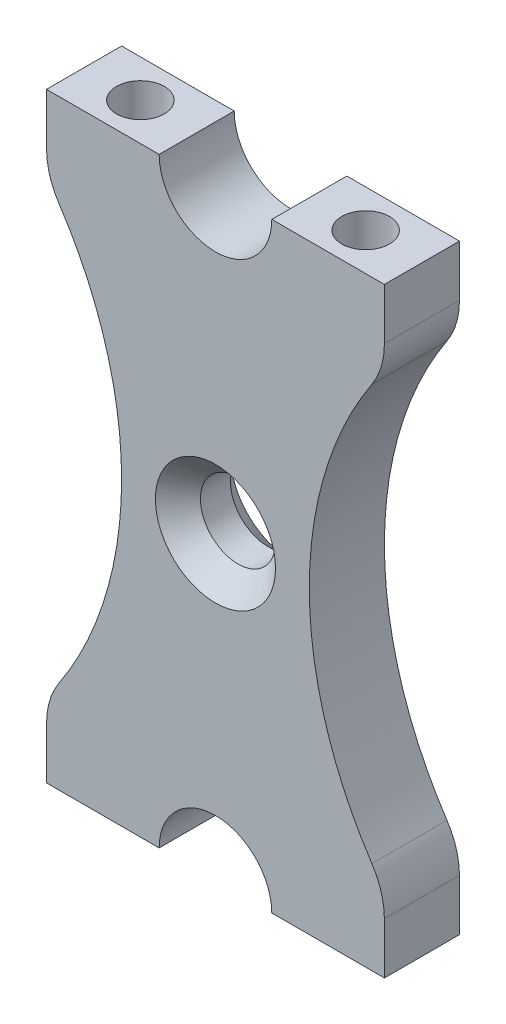
ISO-10303-21;
HEADER;
FILE_DESCRIPTION(('STEP AP214'),'2;1');
FILE_NAME('part.step','',(''),(''),'','','');
FILE_SCHEMA(('AUTOMOTIVE_DESIGN { 1 0 10303 214 1 1 1 1 }'));
ENDSEC;
DATA;
#1=APPLICATION_CONTEXT('core data for automotive mechanical design processes');
#2=APPLICATION_PROTOCOL_DEFINITION('international standard','automotive_design',2000,#1);
#3=PRODUCT_CONTEXT('',#1,'mechanical');
#4=PRODUCT('Part','Part','',(#3));
#5=PRODUCT_RELATED_PRODUCT_CATEGORY('part','',(#4));
#6=PRODUCT_DEFINITION_FORMATION('','',#4);
#7=PRODUCT_DEFINITION_CONTEXT('part definition',#1,'design');
#8=PRODUCT_DEFINITION('design','',#6,#7);
#9=PRODUCT_DEFINITION_SHAPE('','',#8);
#10=(LENGTH_UNIT() NAMED_UNIT(*) SI_UNIT(.MILLI.,.METRE.));
#11=(NAMED_UNIT(*) PLANE_ANGLE_UNIT() SI_UNIT($,.RADIAN.));
#12=(NAMED_UNIT(*) SI_UNIT($,.STERADIAN.) SOLID_ANGLE_UNIT());
#13=UNCERTAINTY_MEASURE_WITH_UNIT(LENGTH_MEASURE(1.E-05),#10,'distance_accuracy_value','');
#14=(GEOMETRIC_REPRESENTATION_CONTEXT(3) GLOBAL_UNCERTAINTY_ASSIGNED_CONTEXT((#13)) GLOBAL_UNIT_ASSIGNED_CONTEXT((#10,
#11,#12)) REPRESENTATION_CONTEXT('',''));
#15=CARTESIAN_POINT('',(0.,0.,0.));
#16=DIRECTION('',(0.,0.,1.));
#17=DIRECTION('',(1.,0.,0.));
#18=AXIS2_PLACEMENT_3D('',#15,#16,#17);
#19=CARTESIAN_POINT('',(14.2875,25.4,6.35));
#20=DIRECTION('',(-1.,0.,0.));
#21=DIRECTION('',(0.,-1.,0.));
#22=AXIS2_PLACEMENT_3D('',#19,#20,#21);
#23=PLANE('',#22);
#24=DIRECTION('',(0.,1.,0.));
#25=VECTOR('',#24,1.);
#26=CARTESIAN_POINT('',(14.2875,25.4,0.));
#27=LINE('',#26,#25);
#28=CARTESIAN_POINT('',(14.2875,-25.4,0.));
#29=VERTEX_POINT('',#28);
#30=CARTESIAN_POINT('',(14.2875,-21.0605674187568,0.));
#31=VERTEX_POINT('',#30);
#32=EDGE_CURVE('E189',#29,#31,#27,.T.);
#33=ORIENTED_EDGE('',*,*,#32,.T.);
#34=DIRECTION('',(0.,0.,1.));
#35=VECTOR('',#34,1.);
#36=CARTESIAN_POINT('',(14.2875,-21.0605674187568,6.35));
#37=LINE('',#36,#35);
#38=CARTESIAN_POINT('',(14.2875,-21.0605674187568,6.35));
#39=VERTEX_POINT('',#38);
#40=EDGE_CURVE('E247',#31,#39,#37,.T.);
#41=ORIENTED_EDGE('',*,*,#40,.T.);
#42=DIRECTION('',(0.,1.,0.));
#43=VECTOR('',#42,1.);
#44=CARTESIAN_POINT('',(14.2875,25.4,6.35));
#45=LINE('',#44,#43);
#46=CARTESIAN_POINT('',(14.2875,-25.4,6.35));
#47=VERTEX_POINT('',#46);
#48=EDGE_CURVE('E322',#47,#39,#45,.T.);
#49=ORIENTED_EDGE('',*,*,#48,.F.);
#50=DIRECTION('',(0.,0.,-1.));
#51=VECTOR('',#50,1.);
#52=CARTESIAN_POINT('',(14.2875,-25.4,6.35));
#53=LINE('',#52,#51);
#54=EDGE_CURVE('E202',#47,#29,#53,.T.);
#55=ORIENTED_EDGE('',*,*,#54,.T.);
#56=EDGE_LOOP('',(#33,#41,#49,#55));
#57=FACE_BOUND('',#56,.T.);
#58=ADVANCED_FACE('F37',(#57),#23,.F.);
#59=CARTESIAN_POINT('',(-14.2875,25.4,6.35));
#60=DIRECTION('',(0.,-1.,0.));
#61=DIRECTION('',(0.,0.,-1.));
#62=AXIS2_PLACEMENT_3D('',#59,#60,#61);
#63=PLANE('',#62);
#64=CARTESIAN_POINT('',(9.525,25.4,3.175));
#65=DIRECTION('',(0.,1.,0.));
#66=DIRECTION('',(0.,0.,1.));
#67=AXIS2_PLACEMENT_3D('',#64,#65,#66);
#68=CIRCLE('',#67,2.0193);
#69=CARTESIAN_POINT('',(9.525,25.4,5.1943));
#70=VERTEX_POINT('',#69);
#71=EDGE_CURVE('E316',#70,#70,#68,.T.);
#72=ORIENTED_EDGE('',*,*,#71,.F.);
#73=EDGE_LOOP('',(#72));
#74=FACE_BOUND('',#73,.T.);
#75=DIRECTION('',(-1.,0.,0.));
#76=VECTOR('',#75,1.);
#77=CARTESIAN_POINT('',(-14.2875,25.4,0.));
#78=LINE('',#77,#76);
#79=CARTESIAN_POINT('',(14.2875,25.4,0.));
#80=VERTEX_POINT('',#79);
#81=CARTESIAN_POINT('',(4.7625,25.4,0.));
#82=VERTEX_POINT('',#81);
#83=EDGE_CURVE('E188',#80,#82,#78,.T.);
#84=ORIENTED_EDGE('',*,*,#83,.T.);
#85=DIRECTION('',(0.,0.,1.));
#86=VECTOR('',#85,1.);
#87=CARTESIAN_POINT('',(4.7625,25.4,0.));
#88=LINE('',#87,#86);
#89=CARTESIAN_POINT('',(4.7625,25.4,6.35));
#90=VERTEX_POINT('',#89);
#91=EDGE_CURVE('E170',#82,#90,#88,.T.);
#92=ORIENTED_EDGE('',*,*,#91,.T.);
#93=DIRECTION('',(-1.,0.,0.));
#94=VECTOR('',#93,1.);
#95=CARTESIAN_POINT('',(-14.2875,25.4,6.35));
#96=LINE('',#95,#94);
#97=CARTESIAN_POINT('',(14.2875,25.4,6.35));
#98=VERTEX_POINT('',#97);
#99=EDGE_CURVE('E325',#98,#90,#96,.T.);
#100=ORIENTED_EDGE('',*,*,#99,.F.);
#101=DIRECTION('',(0.,0.,-1.));
#102=VECTOR('',#101,1.);
#103=CARTESIAN_POINT('',(14.2875,25.4,6.35));
#104=LINE('',#103,#102);
#105=EDGE_CURVE('E211',#98,#80,#104,.T.);
#106=ORIENTED_EDGE('',*,*,#105,.T.);
#107=EDGE_LOOP('',(#84,#92,#100,#106));
#108=FACE_BOUND('',#107,.T.);
#109=ADVANCED_FACE('F359',(#74,#108),#63,.F.);
#110=CARTESIAN_POINT('',(-14.2875,25.4,6.35));
#111=DIRECTION('',(1.,0.,0.));
#112=DIRECTION('',(0.,1.,0.));
#113=AXIS2_PLACEMENT_3D('',#110,#111,#112);
#114=PLANE('',#113);
#115=DIRECTION('',(0.,-1.,0.));
#116=VECTOR('',#115,1.);
#117=CARTESIAN_POINT('',(-14.2875,25.4,0.));
#118=LINE('',#117,#116);
#119=CARTESIAN_POINT('',(-14.2875,25.4,0.));
#120=VERTEX_POINT('',#119);
#121=CARTESIAN_POINT('',(-14.2875,21.0605674187568,0.));
#122=VERTEX_POINT('',#121);
#123=EDGE_CURVE('E187',#120,#122,#118,.T.);
#124=ORIENTED_EDGE('',*,*,#123,.T.);
#125=DIRECTION('',(0.,0.,1.));
#126=VECTOR('',#125,1.);
#127=CARTESIAN_POINT('',(-14.2875,21.0605674187568,6.35));
#128=LINE('',#127,#126);
#129=CARTESIAN_POINT('',(-14.2875,21.0605674187568,6.35));
#130=VERTEX_POINT('',#129);
#131=EDGE_CURVE('E11',#122,#130,#128,.T.);
#132=ORIENTED_EDGE('',*,*,#131,.T.);
#133=DIRECTION('',(0.,-1.,0.));
#134=VECTOR('',#133,1.);
#135=CARTESIAN_POINT('',(-14.2875,25.4,6.35));
#136=LINE('',#135,#134);
#137=CARTESIAN_POINT('',(-14.2875,25.4,6.35));
#138=VERTEX_POINT('',#137);
#139=EDGE_CURVE('E328',#138,#130,#136,.T.);
#140=ORIENTED_EDGE('',*,*,#139,.F.);
#141=DIRECTION('',(0.,0.,-1.));
#142=VECTOR('',#141,1.);
#143=CARTESIAN_POINT('',(-14.2875,25.4,6.35));
#144=LINE('',#143,#142);
#145=EDGE_CURVE('E209',#138,#120,#144,.T.);
#146=ORIENTED_EDGE('',*,*,#145,.T.);
#147=EDGE_LOOP('',(#124,#132,#140,#146));
#148=FACE_BOUND('',#147,.T.);
#149=ADVANCED_FACE('F362',(#148),#114,.F.);
#150=CARTESIAN_POINT('',(-14.2875,-25.4,6.35));
#151=DIRECTION('',(0.,1.,0.));
#152=DIRECTION('',(0.,0.,1.));
#153=AXIS2_PLACEMENT_3D('',#150,#151,#152);
#154=PLANE('',#153);
#155=CARTESIAN_POINT('',(-9.52500000000001,-25.4,3.175));
#156=DIRECTION('',(0.,-1.,0.));
#157=DIRECTION('',(0.,0.,-1.));
#158=AXIS2_PLACEMENT_3D('',#155,#156,#157);
#159=CIRCLE('',#158,2.0193);
#160=CARTESIAN_POINT('',(-9.52500000000001,-25.4,1.15570000000001));
#161=VERTEX_POINT('',#160);
#162=EDGE_CURVE('E282',#161,#161,#159,.T.);
#163=ORIENTED_EDGE('',*,*,#162,.F.);
#164=EDGE_LOOP('',(#163));
#165=FACE_BOUND('',#164,.T.);
#166=DIRECTION('',(1.,0.,0.));
#167=VECTOR('',#166,1.);
#168=CARTESIAN_POINT('',(-14.2875,-25.4,0.));
#169=LINE('',#168,#167);
#170=CARTESIAN_POINT('',(-14.2875,-25.4,0.));
#171=VERTEX_POINT('',#170);
#172=CARTESIAN_POINT('',(-4.7625,-25.4,0.));
#173=VERTEX_POINT('',#172);
#174=EDGE_CURVE('E198',#171,#173,#169,.T.);
#175=ORIENTED_EDGE('',*,*,#174,.T.);
#176=DIRECTION('',(0.,0.,1.));
#177=VECTOR('',#176,1.);
#178=CARTESIAN_POINT('',(-4.7625,-25.4,0.));
#179=LINE('',#178,#177);
#180=CARTESIAN_POINT('',(-4.7625,-25.4,6.35));
#181=VERTEX_POINT('',#180);
#182=EDGE_CURVE('E293',#173,#181,#179,.T.);
#183=ORIENTED_EDGE('',*,*,#182,.T.);
#184=DIRECTION('',(1.,0.,0.));
#185=VECTOR('',#184,1.);
#186=CARTESIAN_POINT('',(-14.2875,-25.4,6.35));
#187=LINE('',#186,#185);
#188=CARTESIAN_POINT('',(-14.2875,-25.4,6.35));
#189=VERTEX_POINT('',#188);
#190=EDGE_CURVE('E206',#189,#181,#187,.T.);
#191=ORIENTED_EDGE('',*,*,#190,.F.);
#192=DIRECTION('',(0.,0.,-1.));
#193=VECTOR('',#192,1.);
#194=CARTESIAN_POINT('',(-14.2875,-25.4,6.35));
#195=LINE('',#194,#193);
#196=EDGE_CURVE('E205',#189,#171,#195,.T.);
#197=ORIENTED_EDGE('',*,*,#196,.T.);
#198=EDGE_LOOP('',(#175,#183,#191,#197));
#199=FACE_BOUND('',#198,.T.);
#200=ADVANCED_FACE('F378',(#165,#199),#154,.F.);
#201=CARTESIAN_POINT('',(14.2875,21.0605674187568,6.35));
#202=VERTEX_POINT('',#201);
#203=EDGE_CURVE('E201',#202,#98,#45,.T.);
#204=ORIENTED_EDGE('',*,*,#203,.F.);
#205=DIRECTION('',(0.,0.,1.));
#206=VECTOR('',#205,1.);
#207=CARTESIAN_POINT('',(14.2875,21.0605674187568,6.35));
#208=LINE('',#207,#206);
#209=CARTESIAN_POINT('',(14.2875,21.0605674187568,0.));
#210=VERTEX_POINT('',#209);
#211=EDGE_CURVE('E239',#202,#210,#208,.F.);
#212=ORIENTED_EDGE('',*,*,#211,.T.);
#213=EDGE_CURVE('E192',#210,#80,#27,.T.);
#214=ORIENTED_EDGE('',*,*,#213,.T.);
#215=ORIENTED_EDGE('',*,*,#105,.F.);
#216=EDGE_LOOP('',(#204,#212,#214,#215));
#217=FACE_BOUND('',#216,.T.);
#218=ADVANCED_FACE('F357',(#217),#23,.F.);
#219=CARTESIAN_POINT('',(-9.52500000000001,25.4,3.175));
#220=DIRECTION('',(0.,1.,0.));
#221=DIRECTION('',(0.,0.,1.));
#222=AXIS2_PLACEMENT_3D('',#219,#220,#221);
#223=CIRCLE('',#222,2.0193);
#224=CARTESIAN_POINT('',(-9.52500000000001,25.4,5.1943));
#225=VERTEX_POINT('',#224);
#226=EDGE_CURVE('E310',#225,#225,#223,.T.);
#227=ORIENTED_EDGE('',*,*,#226,.F.);
#228=EDGE_LOOP('',(#227));
#229=FACE_BOUND('',#228,.T.);
#230=CARTESIAN_POINT('',(-4.7625,25.4,6.35));
#231=VERTEX_POINT('',#230);
#232=EDGE_CURVE('E182',#231,#138,#96,.T.);
#233=ORIENTED_EDGE('',*,*,#232,.F.);
#234=DIRECTION('',(0.,0.,1.));
#235=VECTOR('',#234,1.);
#236=CARTESIAN_POINT('',(-4.7625,25.4,0.));
#237=LINE('',#236,#235);
#238=CARTESIAN_POINT('',(-4.7625,25.4,0.));
#239=VERTEX_POINT('',#238);
#240=EDGE_CURVE('E167',#239,#231,#237,.T.);
#241=ORIENTED_EDGE('',*,*,#240,.F.);
#242=EDGE_CURVE('E180',#239,#120,#78,.T.);
#243=ORIENTED_EDGE('',*,*,#242,.T.);
#244=ORIENTED_EDGE('',*,*,#145,.F.);
#245=EDGE_LOOP('',(#233,#241,#243,#244));
#246=FACE_BOUND('',#245,.T.);
#247=ADVANCED_FACE('F178',(#229,#246),#63,.F.);
#248=CARTESIAN_POINT('',(-14.2875,-21.0605674187568,6.35));
#249=VERTEX_POINT('',#248);
#250=EDGE_CURVE('E260',#249,#189,#136,.T.);
#251=ORIENTED_EDGE('',*,*,#250,.F.);
#252=DIRECTION('',(0.,0.,1.));
#253=VECTOR('',#252,1.);
#254=CARTESIAN_POINT('',(-14.2875,-21.0605674187568,6.35));
#255=LINE('',#254,#253);
#256=CARTESIAN_POINT('',(-14.2875,-21.0605674187568,0.));
#257=VERTEX_POINT('',#256);
#258=EDGE_CURVE('E45',#249,#257,#255,.F.);
#259=ORIENTED_EDGE('',*,*,#258,.T.);
#260=EDGE_CURVE('E191',#257,#171,#118,.T.);
#261=ORIENTED_EDGE('',*,*,#260,.T.);
#262=ORIENTED_EDGE('',*,*,#196,.F.);
#263=EDGE_LOOP('',(#251,#259,#261,#262));
#264=FACE_BOUND('',#263,.T.);
#265=ADVANCED_FACE('F258',(#264),#114,.F.);
#266=CARTESIAN_POINT('',(9.525,-25.4,3.175));
#267=DIRECTION('',(0.,-1.,0.));
#268=DIRECTION('',(0.,0.,-1.));
#269=AXIS2_PLACEMENT_3D('',#266,#267,#268);
#270=CIRCLE('',#269,2.0193);
#271=CARTESIAN_POINT('',(9.525,-25.4,1.15570000000001));
#272=VERTEX_POINT('',#271);
#273=EDGE_CURVE('E304',#272,#272,#270,.T.);
#274=ORIENTED_EDGE('',*,*,#273,.F.);
#275=EDGE_LOOP('',(#274));
#276=FACE_BOUND('',#275,.T.);
#277=CARTESIAN_POINT('',(4.7625,-25.4,6.35));
#278=VERTEX_POINT('',#277);
#279=EDGE_CURVE('E329',#278,#47,#187,.T.);
#280=ORIENTED_EDGE('',*,*,#279,.F.);
#281=DIRECTION('',(0.,0.,1.));
#282=VECTOR('',#281,1.);
#283=CARTESIAN_POINT('',(4.7625,-25.4,0.));
#284=LINE('',#283,#282);
#285=CARTESIAN_POINT('',(4.7625,-25.4,0.));
#286=VERTEX_POINT('',#285);
#287=EDGE_CURVE('E288',#286,#278,#284,.T.);
#288=ORIENTED_EDGE('',*,*,#287,.F.);
#289=EDGE_CURVE('E197',#286,#29,#169,.T.);
#290=ORIENTED_EDGE('',*,*,#289,.T.);
#291=ORIENTED_EDGE('',*,*,#54,.F.);
#292=EDGE_LOOP('',(#280,#288,#290,#291));
#293=FACE_BOUND('',#292,.T.);
#294=ADVANCED_FACE('F338',(#276,#293),#154,.F.);
#295=CARTESIAN_POINT('',(0.,0.,6.35));
#296=DIRECTION('',(0.,0.,1.));
#297=DIRECTION('',(1.,0.,0.));
#298=AXIS2_PLACEMENT_3D('',#295,#296,#297);
#299=PLANE('',#298);
#300=CARTESIAN_POINT('',(39.6875,0.,6.35));
#301=DIRECTION('',(0.,0.,1.));
#302=DIRECTION('',(1.,0.,0.));
#303=AXIS2_PLACEMENT_3D('',#300,#301,#302);
#304=CIRCLE('',#303,31.75);
#305=CARTESIAN_POINT('',(13.2291666666667,17.550472848964,6.35));
#306=VERTEX_POINT('',#305);
#307=CARTESIAN_POINT('',(13.2291666666667,-17.550472848964,6.35));
#308=VERTEX_POINT('',#307);
#309=EDGE_CURVE('E183',#306,#308,#304,.T.);
#310=ORIENTED_EDGE('',*,*,#309,.F.);
#311=CARTESIAN_POINT('',(7.93749999999999,21.0605674187568,6.35));
#312=DIRECTION('',(0.,0.,1.));
#313=DIRECTION('',(1.,0.,0.));
#314=AXIS2_PLACEMENT_3D('',#311,#312,#313);
#315=CIRCLE('',#314,6.35);
#316=EDGE_CURVE('E237',#306,#202,#315,.T.);
#317=ORIENTED_EDGE('',*,*,#316,.T.);
#318=ORIENTED_EDGE('',*,*,#203,.T.);
#319=ORIENTED_EDGE('',*,*,#99,.T.);
#320=CARTESIAN_POINT('',(0.,25.4,6.35));
#321=DIRECTION('',(0.,0.,1.));
#322=DIRECTION('',(1.,0.,0.));
#323=AXIS2_PLACEMENT_3D('',#320,#321,#322);
#324=CIRCLE('',#323,4.7625);
#325=EDGE_CURVE('E174',#231,#90,#324,.T.);
#326=ORIENTED_EDGE('',*,*,#325,.F.);
#327=ORIENTED_EDGE('',*,*,#232,.T.);
#328=ORIENTED_EDGE('',*,*,#139,.T.);
#329=CARTESIAN_POINT('',(-7.93750000000001,21.0605674187568,6.35));
#330=DIRECTION('',(0.,0.,1.));
#331=DIRECTION('',(1.,0.,0.));
#332=AXIS2_PLACEMENT_3D('',#329,#330,#331);
#333=CIRCLE('',#332,6.35);
#334=CARTESIAN_POINT('',(-13.2291666666667,17.550472848964,6.35));
#335=VERTEX_POINT('',#334);
#336=EDGE_CURVE('E231',#130,#335,#333,.T.);
#337=ORIENTED_EDGE('',*,*,#336,.T.);
#338=CARTESIAN_POINT('',(-39.6875,0.,6.35));
#339=DIRECTION('',(0.,0.,1.));
#340=DIRECTION('',(-1.,0.,0.));
#341=AXIS2_PLACEMENT_3D('',#338,#339,#340);
#342=CIRCLE('',#341,31.75);
#343=CARTESIAN_POINT('',(-13.2291666666667,-17.550472848964,6.35));
#344=VERTEX_POINT('',#343);
#345=EDGE_CURVE('E272',#344,#335,#342,.T.);
#346=ORIENTED_EDGE('',*,*,#345,.F.);
#347=CARTESIAN_POINT('',(-7.9375,-21.0605674187568,6.35));
#348=DIRECTION('',(0.,0.,1.));
#349=DIRECTION('',(1.,0.,0.));
#350=AXIS2_PLACEMENT_3D('',#347,#348,#349);
#351=CIRCLE('',#350,6.35);
#352=EDGE_CURVE('E233',#344,#249,#351,.T.);
#353=ORIENTED_EDGE('',*,*,#352,.T.);
#354=ORIENTED_EDGE('',*,*,#250,.T.);
#355=ORIENTED_EDGE('',*,*,#190,.T.);
#356=CARTESIAN_POINT('',(0.,-25.4,6.35));
#357=DIRECTION('',(0.,0.,1.));
#358=DIRECTION('',(-1.,0.,0.));
#359=AXIS2_PLACEMENT_3D('',#356,#357,#358);
#360=CIRCLE('',#359,4.7625);
#361=EDGE_CURVE('E294',#278,#181,#360,.T.);
#362=ORIENTED_EDGE('',*,*,#361,.F.);
#363=ORIENTED_EDGE('',*,*,#279,.T.);
#364=ORIENTED_EDGE('',*,*,#48,.T.);
#365=CARTESIAN_POINT('',(7.9375,-21.0605674187568,6.35));
#366=DIRECTION('',(0.,0.,1.));
#367=DIRECTION('',(1.,0.,0.));
#368=AXIS2_PLACEMENT_3D('',#365,#366,#367);
#369=CIRCLE('',#368,6.35);
#370=EDGE_CURVE('E235',#39,#308,#369,.T.);
#371=ORIENTED_EDGE('',*,*,#370,.T.);
#372=EDGE_LOOP('',(#310,#317,#318,#319,#326,#327,#328,#337,#346,#353,#354,#355,#362,#363,#364,#371));
#373=FACE_BOUND('',#372,.T.);
#374=CARTESIAN_POINT('',(0.,0.,6.35));
#375=DIRECTION('',(0.,0.,1.));
#376=DIRECTION('',(1.,0.,0.));
#377=AXIS2_PLACEMENT_3D('',#374,#375,#376);
#378=CIRCLE('',#377,5.08000000000002);
#379=CARTESIAN_POINT('',(5.08000000000002,0.,6.35));
#380=VERTEX_POINT('',#379);
#381=EDGE_CURVE('E223',#380,#380,#378,.F.);
#382=ORIENTED_EDGE('',*,*,#381,.T.);
#383=EDGE_LOOP('',(#382));
#384=FACE_BOUND('',#383,.T.);
#385=ADVANCED_FACE('F277',(#373,#384),#299,.T.);
#386=CARTESIAN_POINT('',(0.,0.,0.));
#387=DIRECTION('',(0.,0.,1.));
#388=DIRECTION('',(1.,0.,0.));
#389=AXIS2_PLACEMENT_3D('',#386,#387,#388);
#390=PLANE('',#389);
#391=CARTESIAN_POINT('',(0.,0.,0.));
#392=DIRECTION('',(0.,0.,1.));
#393=DIRECTION('',(1.,0.,0.));
#394=AXIS2_PLACEMENT_3D('',#391,#392,#393);
#395=CIRCLE('',#394,5.07999999999999);
#396=CARTESIAN_POINT('',(5.07999999999999,0.,0.));
#397=VERTEX_POINT('',#396);
#398=EDGE_CURVE('E214',#397,#397,#395,.T.);
#399=ORIENTED_EDGE('',*,*,#398,.T.);
#400=EDGE_LOOP('',(#399));
#401=FACE_BOUND('',#400,.T.);
#402=ORIENTED_EDGE('',*,*,#213,.F.);
#403=CARTESIAN_POINT('',(7.93749999999999,21.0605674187568,0.));
#404=DIRECTION('',(0.,0.,1.));
#405=DIRECTION('',(1.,0.,0.));
#406=AXIS2_PLACEMENT_3D('',#403,#404,#405);
#407=CIRCLE('',#406,6.35);
#408=CARTESIAN_POINT('',(13.2291666666667,17.550472848964,0.));
#409=VERTEX_POINT('',#408);
#410=EDGE_CURVE('E245',#210,#409,#407,.F.);
#411=ORIENTED_EDGE('',*,*,#410,.T.);
#412=CARTESIAN_POINT('',(39.6875,0.,0.));
#413=DIRECTION('',(0.,0.,1.));
#414=DIRECTION('',(1.,0.,0.));
#415=AXIS2_PLACEMENT_3D('',#412,#413,#414);
#416=CIRCLE('',#415,31.75);
#417=CARTESIAN_POINT('',(13.2291666666667,-17.550472848964,0.));
#418=VERTEX_POINT('',#417);
#419=EDGE_CURVE('E280',#409,#418,#416,.T.);
#420=ORIENTED_EDGE('',*,*,#419,.T.);
#421=CARTESIAN_POINT('',(7.9375,-21.0605674187568,0.));
#422=DIRECTION('',(0.,0.,1.));
#423=DIRECTION('',(1.,0.,0.));
#424=AXIS2_PLACEMENT_3D('',#421,#422,#423);
#425=CIRCLE('',#424,6.35);
#426=EDGE_CURVE('E52',#418,#31,#425,.F.);
#427=ORIENTED_EDGE('',*,*,#426,.T.);
#428=ORIENTED_EDGE('',*,*,#32,.F.);
#429=ORIENTED_EDGE('',*,*,#289,.F.);
#430=CARTESIAN_POINT('',(0.,-25.4,0.));
#431=DIRECTION('',(0.,0.,1.));
#432=DIRECTION('',(-1.,0.,0.));
#433=AXIS2_PLACEMENT_3D('',#430,#431,#432);
#434=CIRCLE('',#433,4.7625);
#435=EDGE_CURVE('E291',#286,#173,#434,.T.);
#436=ORIENTED_EDGE('',*,*,#435,.T.);
#437=ORIENTED_EDGE('',*,*,#174,.F.);
#438=ORIENTED_EDGE('',*,*,#260,.F.);
#439=CARTESIAN_POINT('',(-7.9375,-21.0605674187568,0.));
#440=DIRECTION('',(0.,0.,1.));
#441=DIRECTION('',(1.,0.,0.));
#442=AXIS2_PLACEMENT_3D('',#439,#440,#441);
#443=CIRCLE('',#442,6.35);
#444=CARTESIAN_POINT('',(-13.2291666666667,-17.550472848964,0.));
#445=VERTEX_POINT('',#444);
#446=EDGE_CURVE('E242',#257,#445,#443,.F.);
#447=ORIENTED_EDGE('',*,*,#446,.T.);
#448=CARTESIAN_POINT('',(-39.6875,0.,0.));
#449=DIRECTION('',(0.,0.,1.));
#450=DIRECTION('',(-1.,0.,0.));
#451=AXIS2_PLACEMENT_3D('',#448,#449,#450);
#452=CIRCLE('',#451,31.75);
#453=CARTESIAN_POINT('',(-13.2291666666667,17.550472848964,0.));
#454=VERTEX_POINT('',#453);
#455=EDGE_CURVE('E274',#445,#454,#452,.T.);
#456=ORIENTED_EDGE('',*,*,#455,.T.);
#457=CARTESIAN_POINT('',(-7.93750000000001,21.0605674187568,0.));
#458=DIRECTION('',(0.,0.,1.));
#459=DIRECTION('',(1.,0.,0.));
#460=AXIS2_PLACEMENT_3D('',#457,#458,#459);
#461=CIRCLE('',#460,6.35);
#462=EDGE_CURVE('E59',#454,#122,#461,.F.);
#463=ORIENTED_EDGE('',*,*,#462,.T.);
#464=ORIENTED_EDGE('',*,*,#123,.F.);
#465=ORIENTED_EDGE('',*,*,#242,.F.);
#466=CARTESIAN_POINT('',(0.,25.4,0.));
#467=DIRECTION('',(0.,0.,1.));
#468=DIRECTION('',(1.,0.,0.));
#469=AXIS2_PLACEMENT_3D('',#466,#467,#468);
#470=CIRCLE('',#469,4.7625);
#471=EDGE_CURVE('E164',#239,#82,#470,.T.);
#472=ORIENTED_EDGE('',*,*,#471,.T.);
#473=ORIENTED_EDGE('',*,*,#83,.F.);
#474=EDGE_LOOP('',(#402,#411,#420,#427,#428,#429,#436,#437,#438,#447,#456,#463,#464,#465,#472,#473));
#475=FACE_BOUND('',#474,.T.);
#476=ADVANCED_FACE('F186',(#401,#475),#390,.F.);
#477=CARTESIAN_POINT('',(9.525,15.748,3.175));
#478=DIRECTION('',(0.,1.,0.));
#479=DIRECTION('',(0.,0.,1.));
#480=AXIS2_PLACEMENT_3D('',#477,#478,#479);
#481=CONICAL_SURFACE('',#480,2.0193,1.02974425867665);
#482=CARTESIAN_POINT('',(9.52499999999999,14.5346821519976,3.175));
#483=VERTEX_POINT('',#482);
#484=VERTEX_LOOP('',#483);
#485=FACE_BOUND('',#484,.T.);
#486=CARTESIAN_POINT('',(9.525,15.748,3.175));
#487=DIRECTION('',(0.,1.,0.));
#488=DIRECTION('',(0.,0.,1.));
#489=AXIS2_PLACEMENT_3D('',#486,#487,#488);
#490=CIRCLE('',#489,2.0193);
#491=CARTESIAN_POINT('',(9.525,15.748,5.1943));
#492=VERTEX_POINT('',#491);
#493=EDGE_CURVE('E319',#492,#492,#490,.T.);
#494=ORIENTED_EDGE('',*,*,#493,.T.);
#495=EDGE_LOOP('',(#494));
#496=FACE_BOUND('',#495,.T.);
#497=ADVANCED_FACE('F431',(#485,#496),#481,.F.);
#498=CARTESIAN_POINT('',(9.525,25.4,3.175));
#499=DIRECTION('',(0.,1.,0.));
#500=DIRECTION('',(0.,0.,1.));
#501=AXIS2_PLACEMENT_3D('',#498,#499,#500);
#502=CYLINDRICAL_SURFACE('',#501,2.0193);
#503=ORIENTED_EDGE('',*,*,#493,.F.);
#504=EDGE_LOOP('',(#503));
#505=FACE_BOUND('',#504,.T.);
#506=ORIENTED_EDGE('',*,*,#71,.T.);
#507=EDGE_LOOP('',(#506));
#508=FACE_BOUND('',#507,.T.);
#509=ADVANCED_FACE('F427',(#505,#508),#502,.F.);
#510=CARTESIAN_POINT('',(-9.52500000000001,15.748,3.175));
#511=DIRECTION('',(0.,1.,0.));
#512=DIRECTION('',(0.,0.,1.));
#513=AXIS2_PLACEMENT_3D('',#510,#511,#512);
#514=CONICAL_SURFACE('',#513,2.0193,1.02974425867665);
#515=CARTESIAN_POINT('',(-9.52500000000001,14.5346821519976,3.175));
#516=VERTEX_POINT('',#515);
#517=VERTEX_LOOP('',#516);
#518=FACE_BOUND('',#517,.T.);
#519=CARTESIAN_POINT('',(-9.52500000000001,15.748,3.175));
#520=DIRECTION('',(0.,1.,0.));
#521=DIRECTION('',(0.,0.,1.));
#522=AXIS2_PLACEMENT_3D('',#519,#520,#521);
#523=CIRCLE('',#522,2.0193);
#524=CARTESIAN_POINT('',(-9.52500000000001,15.748,5.1943));
#525=VERTEX_POINT('',#524);
#526=EDGE_CURVE('E313',#525,#525,#523,.T.);
#527=ORIENTED_EDGE('',*,*,#526,.T.);
#528=EDGE_LOOP('',(#527));
#529=FACE_BOUND('',#528,.T.);
#530=ADVANCED_FACE('F423',(#518,#529),#514,.F.);
#531=CARTESIAN_POINT('',(-9.52500000000001,25.4,3.175));
#532=DIRECTION('',(0.,1.,0.));
#533=DIRECTION('',(0.,0.,1.));
#534=AXIS2_PLACEMENT_3D('',#531,#532,#533);
#535=CYLINDRICAL_SURFACE('',#534,2.0193);
#536=ORIENTED_EDGE('',*,*,#526,.F.);
#537=EDGE_LOOP('',(#536));
#538=FACE_BOUND('',#537,.T.);
#539=ORIENTED_EDGE('',*,*,#226,.T.);
#540=EDGE_LOOP('',(#539));
#541=FACE_BOUND('',#540,.T.);
#542=ADVANCED_FACE('F415',(#538,#541),#535,.F.);
#543=CARTESIAN_POINT('',(9.525,-15.748,3.175));
#544=DIRECTION('',(0.,-1.,0.));
#545=DIRECTION('',(0.,0.,-1.));
#546=AXIS2_PLACEMENT_3D('',#543,#544,#545);
#547=CONICAL_SURFACE('',#546,2.0193,1.02974425867665);
#548=CARTESIAN_POINT('',(9.52499999999999,-14.5346821519976,3.175));
#549=VERTEX_POINT('',#548);
#550=VERTEX_LOOP('',#549);
#551=FACE_BOUND('',#550,.T.);
#552=CARTESIAN_POINT('',(9.525,-15.748,3.175));
#553=DIRECTION('',(0.,-1.,0.));
#554=DIRECTION('',(0.,0.,-1.));
#555=AXIS2_PLACEMENT_3D('',#552,#553,#554);
#556=CIRCLE('',#555,2.0193);
#557=CARTESIAN_POINT('',(9.525,-15.748,1.15570000000001));
#558=VERTEX_POINT('',#557);
#559=EDGE_CURVE('E307',#558,#558,#556,.T.);
#560=ORIENTED_EDGE('',*,*,#559,.T.);
#561=EDGE_LOOP('',(#560));
#562=FACE_BOUND('',#561,.T.);
#563=ADVANCED_FACE('F405',(#551,#562),#547,.F.);
#564=CARTESIAN_POINT('',(9.525,-25.4,3.175));
#565=DIRECTION('',(0.,-1.,0.));
#566=DIRECTION('',(0.,0.,-1.));
#567=AXIS2_PLACEMENT_3D('',#564,#565,#566);
#568=CYLINDRICAL_SURFACE('',#567,2.0193);
#569=ORIENTED_EDGE('',*,*,#559,.F.);
#570=EDGE_LOOP('',(#569));
#571=FACE_BOUND('',#570,.T.);
#572=ORIENTED_EDGE('',*,*,#273,.T.);
#573=EDGE_LOOP('',(#572));
#574=FACE_BOUND('',#573,.T.);
#575=ADVANCED_FACE('F402',(#571,#574),#568,.F.);
#576=CARTESIAN_POINT('',(-9.52500000000001,-15.748,3.175));
#577=DIRECTION('',(0.,-1.,0.));
#578=DIRECTION('',(0.,0.,-1.));
#579=AXIS2_PLACEMENT_3D('',#576,#577,#578);
#580=CONICAL_SURFACE('',#579,2.0193,1.02974425867665);
#581=CARTESIAN_POINT('',(-9.52500000000001,-14.5346821519976,3.175));
#582=VERTEX_POINT('',#581);
#583=VERTEX_LOOP('',#582);
#584=FACE_BOUND('',#583,.T.);
#585=CARTESIAN_POINT('',(-9.52500000000001,-15.748,3.175));
#586=DIRECTION('',(0.,-1.,0.));
#587=DIRECTION('',(0.,0.,-1.));
#588=AXIS2_PLACEMENT_3D('',#585,#586,#587);
#589=CIRCLE('',#588,2.0193);
#590=CARTESIAN_POINT('',(-9.52500000000001,-15.748,1.15570000000001));
#591=VERTEX_POINT('',#590);
#592=EDGE_CURVE('E301',#591,#591,#589,.T.);
#593=ORIENTED_EDGE('',*,*,#592,.T.);
#594=EDGE_LOOP('',(#593));
#595=FACE_BOUND('',#594,.T.);
#596=ADVANCED_FACE('F404',(#584,#595),#580,.F.);
#597=CARTESIAN_POINT('',(-9.52500000000001,-25.4,3.175));
#598=DIRECTION('',(0.,-1.,0.));
#599=DIRECTION('',(0.,0.,-1.));
#600=AXIS2_PLACEMENT_3D('',#597,#598,#599);
#601=CYLINDRICAL_SURFACE('',#600,2.0193);
#602=ORIENTED_EDGE('',*,*,#592,.F.);
#603=EDGE_LOOP('',(#602));
#604=FACE_BOUND('',#603,.T.);
#605=ORIENTED_EDGE('',*,*,#162,.T.);
#606=EDGE_LOOP('',(#605));
#607=FACE_BOUND('',#606,.T.);
#608=ADVANCED_FACE('F412',(#604,#607),#601,.F.);
#609=CARTESIAN_POINT('',(0.,0.,6.35));
#610=DIRECTION('',(0.,0.,1.));
#611=DIRECTION('',(1.,0.,0.));
#612=AXIS2_PLACEMENT_3D('',#609,#610,#611);
#613=CYLINDRICAL_SURFACE('',#612,3.175);
#614=CARTESIAN_POINT('',(0.,0.,1.905));
#615=DIRECTION('',(0.,0.,1.));
#616=DIRECTION('',(1.,0.,0.));
#617=AXIS2_PLACEMENT_3D('',#614,#615,#616);
#618=CIRCLE('',#617,3.175);
#619=CARTESIAN_POINT('',(3.175,0.,1.905));
#620=VERTEX_POINT('',#619);
#621=EDGE_CURVE('E220',#620,#620,#618,.F.);
#622=ORIENTED_EDGE('',*,*,#621,.T.);
#623=EDGE_LOOP('',(#622));
#624=FACE_BOUND('',#623,.T.);
#625=CARTESIAN_POINT('',(0.,0.,4.44499999999998));
#626=DIRECTION('',(0.,0.,1.));
#627=DIRECTION('',(1.,0.,0.));
#628=AXIS2_PLACEMENT_3D('',#625,#626,#627);
#629=CIRCLE('',#628,3.175);
#630=CARTESIAN_POINT('',(3.175,0.,4.44499999999998));
#631=VERTEX_POINT('',#630);
#632=EDGE_CURVE('E217',#631,#631,#629,.T.);
#633=ORIENTED_EDGE('',*,*,#632,.T.);
#634=EDGE_LOOP('',(#633));
#635=FACE_BOUND('',#634,.T.);
#636=ADVANCED_FACE('F444',(#624,#635),#613,.F.);
#637=CARTESIAN_POINT('',(0.,0.,0.));
#638=DIRECTION('',(0.,0.,-1.));
#639=DIRECTION('',(-1.,0.,0.));
#640=AXIS2_PLACEMENT_3D('',#637,#638,#639);
#641=CONICAL_SURFACE('',#640,5.07999999999999,0.785398163397446);
#642=ORIENTED_EDGE('',*,*,#621,.F.);
#643=EDGE_LOOP('',(#642));
#644=FACE_BOUND('',#643,.T.);
#645=ORIENTED_EDGE('',*,*,#398,.F.);
#646=EDGE_LOOP('',(#645));
#647=FACE_BOUND('',#646,.T.);
#648=ADVANCED_FACE('F441',(#644,#647),#641,.F.);
#649=CARTESIAN_POINT('',(0.,0.,4.44499999999998));
#650=DIRECTION('',(0.,0.,1.));
#651=DIRECTION('',(1.,0.,0.));
#652=AXIS2_PLACEMENT_3D('',#649,#650,#651);
#653=CONICAL_SURFACE('',#652,3.175,0.785398163397451);
#654=ORIENTED_EDGE('',*,*,#381,.F.);
#655=EDGE_LOOP('',(#654));
#656=FACE_BOUND('',#655,.T.);
#657=ORIENTED_EDGE('',*,*,#632,.F.);
#658=EDGE_LOOP('',(#657));
#659=FACE_BOUND('',#658,.T.);
#660=ADVANCED_FACE('F443',(#656,#659),#653,.F.);
#661=CARTESIAN_POINT('',(0.,-25.4,0.));
#662=DIRECTION('',(0.,0.,1.));
#663=DIRECTION('',(1.,0.,0.));
#664=AXIS2_PLACEMENT_3D('',#661,#662,#663);
#665=CYLINDRICAL_SURFACE('',#664,4.7625);
#666=ORIENTED_EDGE('',*,*,#361,.T.);
#667=ORIENTED_EDGE('',*,*,#182,.F.);
#668=ORIENTED_EDGE('',*,*,#435,.F.);
#669=ORIENTED_EDGE('',*,*,#287,.T.);
#670=EDGE_LOOP('',(#666,#667,#668,#669));
#671=FACE_BOUND('',#670,.T.);
#672=ADVANCED_FACE('F450',(#671),#665,.F.);
#673=CARTESIAN_POINT('',(0.,25.4,0.));
#674=DIRECTION('',(0.,0.,1.));
#675=DIRECTION('',(1.,0.,0.));
#676=AXIS2_PLACEMENT_3D('',#673,#674,#675);
#677=CYLINDRICAL_SURFACE('',#676,4.7625);
#678=ORIENTED_EDGE('',*,*,#325,.T.);
#679=ORIENTED_EDGE('',*,*,#91,.F.);
#680=ORIENTED_EDGE('',*,*,#471,.F.);
#681=ORIENTED_EDGE('',*,*,#240,.T.);
#682=EDGE_LOOP('',(#678,#679,#680,#681));
#683=FACE_BOUND('',#682,.T.);
#684=ADVANCED_FACE('F166',(#683),#677,.F.);
#685=CARTESIAN_POINT('',(39.6875,0.,0.));
#686=DIRECTION('',(0.,0.,1.));
#687=DIRECTION('',(1.,0.,0.));
#688=AXIS2_PLACEMENT_3D('',#685,#686,#687);
#689=CYLINDRICAL_SURFACE('',#688,31.75);
#690=ORIENTED_EDGE('',*,*,#419,.F.);
#691=DIRECTION('',(0.,0.,1.));
#692=VECTOR('',#691,1.);
#693=CARTESIAN_POINT('',(13.2291666666667,17.550472848964,0.));
#694=LINE('',#693,#692);
#695=EDGE_CURVE('E228',#409,#306,#694,.T.);
#696=ORIENTED_EDGE('',*,*,#695,.T.);
#697=ORIENTED_EDGE('',*,*,#309,.T.);
#698=DIRECTION('',(0.,0.,1.));
#699=VECTOR('',#698,1.);
#700=CARTESIAN_POINT('',(13.2291666666667,-17.550472848964,0.));
#701=LINE('',#700,#699);
#702=EDGE_CURVE('E226',#308,#418,#701,.F.);
#703=ORIENTED_EDGE('',*,*,#702,.T.);
#704=EDGE_LOOP('',(#690,#696,#697,#703));
#705=FACE_BOUND('',#704,.T.);
#706=ADVANCED_FACE('F347',(#705),#689,.F.);
#707=CARTESIAN_POINT('',(-39.6875,0.,0.));
#708=DIRECTION('',(0.,0.,1.));
#709=DIRECTION('',(1.,0.,0.));
#710=AXIS2_PLACEMENT_3D('',#707,#708,#709);
#711=CYLINDRICAL_SURFACE('',#710,31.75);
#712=ORIENTED_EDGE('',*,*,#455,.F.);
#713=DIRECTION('',(0.,0.,1.));
#714=VECTOR('',#713,1.);
#715=CARTESIAN_POINT('',(-13.2291666666667,-17.550472848964,0.));
#716=LINE('',#715,#714);
#717=EDGE_CURVE('E252',#445,#344,#716,.T.);
#718=ORIENTED_EDGE('',*,*,#717,.T.);
#719=ORIENTED_EDGE('',*,*,#345,.T.);
#720=DIRECTION('',(0.,0.,1.));
#721=VECTOR('',#720,1.);
#722=CARTESIAN_POINT('',(-13.2291666666667,17.550472848964,0.));
#723=LINE('',#722,#721);
#724=EDGE_CURVE('E250',#335,#454,#723,.F.);
#725=ORIENTED_EDGE('',*,*,#724,.T.);
#726=EDGE_LOOP('',(#712,#718,#719,#725));
#727=FACE_BOUND('',#726,.T.);
#728=ADVANCED_FACE('F271',(#727),#711,.F.);
#729=CARTESIAN_POINT('',(7.93749999999999,21.0605674187568,0.));
#730=DIRECTION('',(0.,0.,1.));
#731=DIRECTION('',(1.,0.,0.));
#732=AXIS2_PLACEMENT_3D('',#729,#730,#731);
#733=CYLINDRICAL_SURFACE('',#732,6.35);
#734=ORIENTED_EDGE('',*,*,#410,.F.);
#735=ORIENTED_EDGE('',*,*,#211,.F.);
#736=ORIENTED_EDGE('',*,*,#316,.F.);
#737=ORIENTED_EDGE('',*,*,#695,.F.);
#738=EDGE_LOOP('',(#734,#735,#736,#737));
#739=FACE_BOUND('',#738,.T.);
#740=ADVANCED_FACE('F351',(#739),#733,.T.);
#741=CARTESIAN_POINT('',(7.9375,-21.0605674187568,0.));
#742=DIRECTION('',(0.,0.,1.));
#743=DIRECTION('',(1.,0.,0.));
#744=AXIS2_PLACEMENT_3D('',#741,#742,#743);
#745=CYLINDRICAL_SURFACE('',#744,6.35);
#746=ORIENTED_EDGE('',*,*,#426,.F.);
#747=ORIENTED_EDGE('',*,*,#702,.F.);
#748=ORIENTED_EDGE('',*,*,#370,.F.);
#749=ORIENTED_EDGE('',*,*,#40,.F.);
#750=EDGE_LOOP('',(#746,#747,#748,#749));
#751=FACE_BOUND('',#750,.T.);
#752=ADVANCED_FACE('F343',(#751),#745,.T.);
#753=CARTESIAN_POINT('',(-7.9375,-21.0605674187568,0.));
#754=DIRECTION('',(0.,0.,1.));
#755=DIRECTION('',(1.,0.,0.));
#756=AXIS2_PLACEMENT_3D('',#753,#754,#755);
#757=CYLINDRICAL_SURFACE('',#756,6.35);
#758=ORIENTED_EDGE('',*,*,#446,.F.);
#759=ORIENTED_EDGE('',*,*,#258,.F.);
#760=ORIENTED_EDGE('',*,*,#352,.F.);
#761=ORIENTED_EDGE('',*,*,#717,.F.);
#762=EDGE_LOOP('',(#758,#759,#760,#761));
#763=FACE_BOUND('',#762,.T.);
#764=ADVANCED_FACE('F267',(#763),#757,.T.);
#765=CARTESIAN_POINT('',(-7.93750000000001,21.0605674187568,0.));
#766=DIRECTION('',(0.,0.,1.));
#767=DIRECTION('',(1.,0.,0.));
#768=AXIS2_PLACEMENT_3D('',#765,#766,#767);
#769=CYLINDRICAL_SURFACE('',#768,6.35);
#770=ORIENTED_EDGE('',*,*,#462,.F.);
#771=ORIENTED_EDGE('',*,*,#724,.F.);
#772=ORIENTED_EDGE('',*,*,#336,.F.);
#773=ORIENTED_EDGE('',*,*,#131,.F.);
#774=EDGE_LOOP('',(#770,#771,#772,#773));
#775=FACE_BOUND('',#774,.T.);
#776=ADVANCED_FACE('F39',(#775),#769,.T.);
#777=CLOSED_SHELL('',(#58,#109,#149,#200,#218,#247,#265,#294,#385,#476,#497,#509,#530,#542,#563,
#575,#596,#608,#636,#648,#660,#672,#684,#706,#728,#740,#752,#764,#776));
#778=MANIFOLD_SOLID_BREP('B2',#777);
#779=ADVANCED_BREP_SHAPE_REPRESENTATION('',(#18,#778),#14);
#780=SHAPE_DEFINITION_REPRESENTATION(#9,#779);
ENDSEC;
END-ISO-10303-21;
